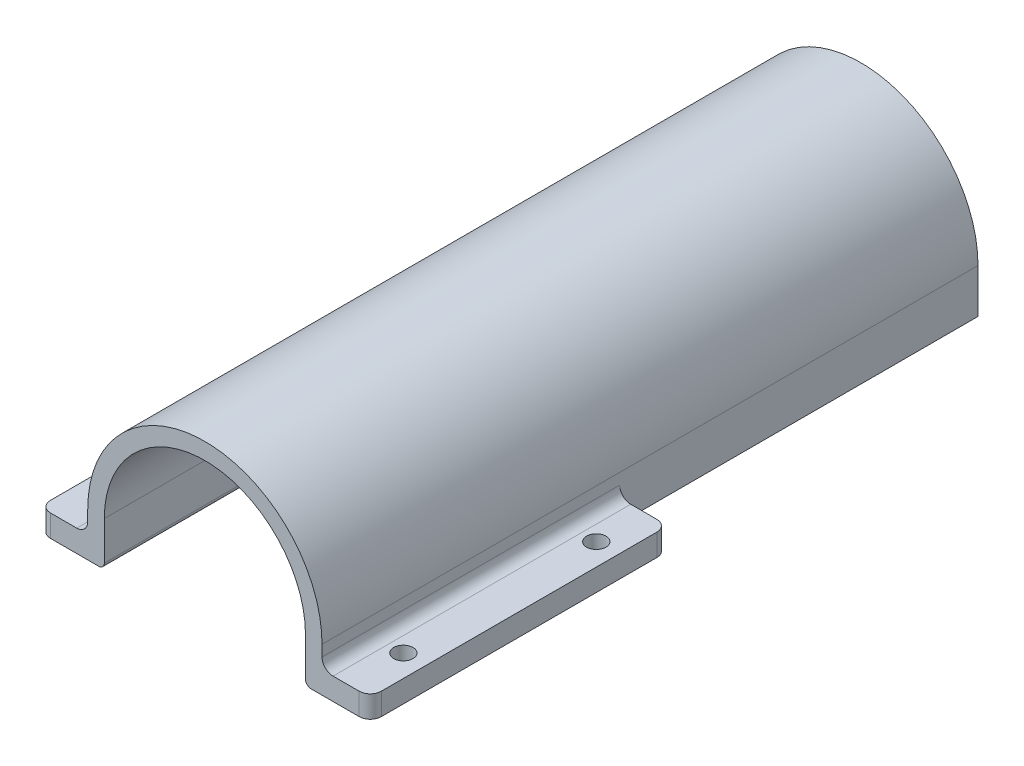
ISO-10303-21;
HEADER;
FILE_DESCRIPTION(('STEP AP214'),'2;1');
FILE_NAME('part.step','',(''),(''),'','','');
FILE_SCHEMA(('AUTOMOTIVE_DESIGN { 1 0 10303 214 1 1 1 1 }'));
ENDSEC;
DATA;
#1=APPLICATION_CONTEXT('core data for automotive mechanical design processes');
#2=APPLICATION_PROTOCOL_DEFINITION('international standard','automotive_design',2000,#1);
#3=PRODUCT_CONTEXT('',#1,'mechanical');
#4=PRODUCT('Part','Part','',(#3));
#5=PRODUCT_RELATED_PRODUCT_CATEGORY('part','',(#4));
#6=PRODUCT_DEFINITION_FORMATION('','',#4);
#7=PRODUCT_DEFINITION_CONTEXT('part definition',#1,'design');
#8=PRODUCT_DEFINITION('design','',#6,#7);
#9=PRODUCT_DEFINITION_SHAPE('','',#8);
#10=(LENGTH_UNIT() NAMED_UNIT(*) SI_UNIT(.MILLI.,.METRE.));
#11=(NAMED_UNIT(*) PLANE_ANGLE_UNIT() SI_UNIT($,.RADIAN.));
#12=(NAMED_UNIT(*) SI_UNIT($,.STERADIAN.) SOLID_ANGLE_UNIT());
#13=UNCERTAINTY_MEASURE_WITH_UNIT(LENGTH_MEASURE(1.E-05),#10,'distance_accuracy_value','');
#14=(GEOMETRIC_REPRESENTATION_CONTEXT(3) GLOBAL_UNCERTAINTY_ASSIGNED_CONTEXT((#13)) GLOBAL_UNIT_ASSIGNED_CONTEXT((#10,
#11,#12)) REPRESENTATION_CONTEXT('',''));
#15=CARTESIAN_POINT('',(0.,0.,0.));
#16=DIRECTION('',(0.,0.,1.));
#17=DIRECTION('',(1.,0.,0.));
#18=AXIS2_PLACEMENT_3D('',#15,#16,#17);
#19=CARTESIAN_POINT('',(-18.25,0.,54.));
#20=DIRECTION('',(1.,0.,0.));
#21=DIRECTION('',(0.,0.,-1.));
#22=AXIS2_PLACEMENT_3D('',#19,#20,#21);
#23=PLANE('',#22);
#24=DIRECTION('',(0.,0.,-1.));
#25=VECTOR('',#24,1.);
#26=CARTESIAN_POINT('',(-18.25,1.,0.));
#27=LINE('',#26,#25);
#28=CARTESIAN_POINT('',(-18.25,1.,54.));
#29=VERTEX_POINT('',#28);
#30=CARTESIAN_POINT('',(-18.25,1.,-63.));
#31=VERTEX_POINT('',#30);
#32=EDGE_CURVE('E48',#29,#31,#27,.T.);
#33=ORIENTED_EDGE('',*,*,#32,.T.);
#34=DIRECTION('',(0.,-1.,0.));
#35=VECTOR('',#34,1.);
#36=CARTESIAN_POINT('',(-18.25,0.,-63.));
#37=LINE('',#36,#35);
#38=CARTESIAN_POINT('',(-18.25,8.,-63.));
#39=VERTEX_POINT('',#38);
#40=EDGE_CURVE('E216',#39,#31,#37,.T.);
#41=ORIENTED_EDGE('',*,*,#40,.F.);
#42=DIRECTION('',(0.,0.,-1.));
#43=VECTOR('',#42,1.);
#44=CARTESIAN_POINT('',(-18.25,8.,54.));
#45=LINE('',#44,#43);
#46=CARTESIAN_POINT('',(-18.25,8.,54.));
#47=VERTEX_POINT('',#46);
#48=EDGE_CURVE('E390',#47,#39,#45,.T.);
#49=ORIENTED_EDGE('',*,*,#48,.F.);
#50=DIRECTION('',(0.,-1.,0.));
#51=VECTOR('',#50,1.);
#52=CARTESIAN_POINT('',(-18.25,0.,54.));
#53=LINE('',#52,#51);
#54=EDGE_CURVE('E241',#47,#29,#53,.T.);
#55=ORIENTED_EDGE('',*,*,#54,.T.);
#56=EDGE_LOOP('',(#33,#41,#49,#55));
#57=FACE_BOUND('',#56,.T.);
#58=ADVANCED_FACE('F40',(#57),#23,.T.);
#59=CARTESIAN_POINT('',(0.,8.,54.));
#60=DIRECTION('',(0.,0.,-1.));
#61=DIRECTION('',(-1.,0.,0.));
#62=AXIS2_PLACEMENT_3D('',#59,#60,#61);
#63=CYLINDRICAL_SURFACE('',#62,18.25);
#64=ORIENTED_EDGE('',*,*,#48,.T.);
#65=CARTESIAN_POINT('',(0.,8.,-63.));
#66=DIRECTION('',(0.,0.,-1.));
#67=DIRECTION('',(-1.,0.,0.));
#68=AXIS2_PLACEMENT_3D('',#65,#66,#67);
#69=CIRCLE('',#68,18.25);
#70=CARTESIAN_POINT('',(18.25,8.,-63.));
#71=VERTEX_POINT('',#70);
#72=EDGE_CURVE('E248',#71,#39,#69,.F.);
#73=ORIENTED_EDGE('',*,*,#72,.F.);
#74=DIRECTION('',(0.,0.,-1.));
#75=VECTOR('',#74,1.);
#76=CARTESIAN_POINT('',(18.25,8.,54.));
#77=LINE('',#76,#75);
#78=CARTESIAN_POINT('',(18.25,8.,54.));
#79=VERTEX_POINT('',#78);
#80=EDGE_CURVE('E223',#79,#71,#77,.T.);
#81=ORIENTED_EDGE('',*,*,#80,.F.);
#82=CARTESIAN_POINT('',(0.,8.,54.));
#83=DIRECTION('',(0.,0.,1.));
#84=DIRECTION('',(1.,0.,0.));
#85=AXIS2_PLACEMENT_3D('',#82,#83,#84);
#86=CIRCLE('',#85,18.25);
#87=EDGE_CURVE('E342',#79,#47,#86,.T.);
#88=ORIENTED_EDGE('',*,*,#87,.T.);
#89=EDGE_LOOP('',(#64,#73,#81,#88));
#90=FACE_BOUND('',#89,.T.);
#91=ADVANCED_FACE('F473',(#90),#63,.F.);
#92=CARTESIAN_POINT('',(18.25,0.,54.));
#93=DIRECTION('',(1.,0.,0.));
#94=DIRECTION('',(0.,0.,-1.));
#95=AXIS2_PLACEMENT_3D('',#92,#93,#94);
#96=PLANE('',#95);
#97=DIRECTION('',(0.,1.,0.));
#98=VECTOR('',#97,1.);
#99=CARTESIAN_POINT('',(18.25,0.,-63.));
#100=LINE('',#99,#98);
#101=CARTESIAN_POINT('',(18.25,1.,-63.));
#102=VERTEX_POINT('',#101);
#103=EDGE_CURVE('E213',#102,#71,#100,.T.);
#104=ORIENTED_EDGE('',*,*,#103,.F.);
#105=DIRECTION('',(0.,0.,-1.));
#106=VECTOR('',#105,1.);
#107=CARTESIAN_POINT('',(18.25,1.,54.));
#108=LINE('',#107,#106);
#109=CARTESIAN_POINT('',(18.25,1.,54.));
#110=VERTEX_POINT('',#109);
#111=EDGE_CURVE('E208',#102,#110,#108,.F.);
#112=ORIENTED_EDGE('',*,*,#111,.T.);
#113=DIRECTION('',(0.,-1.,0.));
#114=VECTOR('',#113,1.);
#115=CARTESIAN_POINT('',(18.25,0.,54.));
#116=LINE('',#115,#114);
#117=EDGE_CURVE('E345',#79,#110,#116,.T.);
#118=ORIENTED_EDGE('',*,*,#117,.F.);
#119=ORIENTED_EDGE('',*,*,#80,.T.);
#120=EDGE_LOOP('',(#104,#112,#118,#119));
#121=FACE_BOUND('',#120,.T.);
#122=ADVANCED_FACE('F220',(#121),#96,.F.);
#123=CARTESIAN_POINT('',(0.,0.,0.));
#124=DIRECTION('',(0.,0.,1.));
#125=DIRECTION('',(1.,0.,0.));
#126=AXIS2_PLACEMENT_3D('',#123,#124,#125);
#127=PLANE('',#126);
#128=DIRECTION('',(0.,-1.,0.));
#129=VECTOR('',#128,1.);
#130=CARTESIAN_POINT('',(21.25,0.,0.));
#131=LINE('',#130,#129);
#132=CARTESIAN_POINT('',(21.25,6.,0.));
#133=VERTEX_POINT('',#132);
#134=CARTESIAN_POINT('',(21.25,0.,0.));
#135=VERTEX_POINT('',#134);
#136=EDGE_CURVE('E250',#133,#135,#131,.T.);
#137=ORIENTED_EDGE('',*,*,#136,.F.);
#138=CARTESIAN_POINT('',(23.25,6.,0.));
#139=DIRECTION('',(0.,0.,1.));
#140=DIRECTION('',(1.,0.,0.));
#141=AXIS2_PLACEMENT_3D('',#138,#139,#140);
#142=CIRCLE('',#141,2.);
#143=CARTESIAN_POINT('',(23.25,4.,0.));
#144=VERTEX_POINT('',#143);
#145=EDGE_CURVE('E336',#144,#133,#142,.F.);
#146=ORIENTED_EDGE('',*,*,#145,.F.);
#147=DIRECTION('',(-1.,0.,0.));
#148=VECTOR('',#147,1.);
#149=CARTESIAN_POINT('',(0.,4.,0.));
#150=LINE('',#149,#148);
#151=CARTESIAN_POINT('',(28.,4.,0.));
#152=VERTEX_POINT('',#151);
#153=EDGE_CURVE('E368',#152,#144,#150,.T.);
#154=ORIENTED_EDGE('',*,*,#153,.F.);
#155=DIRECTION('',(0.,-1.,0.));
#156=VECTOR('',#155,1.);
#157=CARTESIAN_POINT('',(28.,29.251,0.));
#158=LINE('',#157,#156);
#159=CARTESIAN_POINT('',(28.,0.,0.));
#160=VERTEX_POINT('',#159);
#161=EDGE_CURVE('E321',#152,#160,#158,.T.);
#162=ORIENTED_EDGE('',*,*,#161,.T.);
#163=DIRECTION('',(-1.,0.,0.));
#164=VECTOR('',#163,1.);
#165=CARTESIAN_POINT('',(0.,0.,0.));
#166=LINE('',#165,#164);
#167=EDGE_CURVE('E63',#160,#135,#166,.T.);
#168=ORIENTED_EDGE('',*,*,#167,.T.);
#169=EDGE_LOOP('',(#137,#146,#154,#162,#168));
#170=FACE_BOUND('',#169,.T.);
#171=ADVANCED_FACE('F480',(#170),#127,.F.);
#172=CARTESIAN_POINT('',(0.,4.,54.));
#173=DIRECTION('',(0.,1.,0.));
#174=DIRECTION('',(-1.,0.,0.));
#175=AXIS2_PLACEMENT_3D('',#172,#173,#174);
#176=PLANE('',#175);
#177=CARTESIAN_POINT('',(-26.,4.,9.00000000000001));
#178=DIRECTION('',(0.,1.,0.));
#179=DIRECTION('',(-1.,0.,0.));
#180=AXIS2_PLACEMENT_3D('',#177,#178,#179);
#181=CIRCLE('',#180,1.75);
#182=CARTESIAN_POINT('',(-27.75,4.,9.00000000000001));
#183=VERTEX_POINT('',#182);
#184=EDGE_CURVE('E279',#183,#183,#181,.T.);
#185=ORIENTED_EDGE('',*,*,#184,.F.);
#186=EDGE_LOOP('',(#185));
#187=FACE_BOUND('',#186,.T.);
#188=CARTESIAN_POINT('',(-25.9999999999996,4.,44.));
#189=DIRECTION('',(0.,1.,0.));
#190=DIRECTION('',(-1.,0.,0.));
#191=AXIS2_PLACEMENT_3D('',#188,#189,#190);
#192=CIRCLE('',#191,1.75);
#193=CARTESIAN_POINT('',(-27.7499999999996,4.,44.));
#194=VERTEX_POINT('',#193);
#195=EDGE_CURVE('E278',#194,#194,#192,.T.);
#196=ORIENTED_EDGE('',*,*,#195,.F.);
#197=EDGE_LOOP('',(#196));
#198=FACE_BOUND('',#197,.T.);
#199=CARTESIAN_POINT('',(-28.,4.,2.00000000000001));
#200=DIRECTION('',(0.,1.,0.));
#201=DIRECTION('',(-1.,0.,0.));
#202=AXIS2_PLACEMENT_3D('',#199,#200,#201);
#203=CIRCLE('',#202,2.);
#204=CARTESIAN_POINT('',(-28.,4.,0.));
#205=VERTEX_POINT('',#204);
#206=CARTESIAN_POINT('',(-30.,4.,2.00000000000002));
#207=VERTEX_POINT('',#206);
#208=EDGE_CURVE('E285',#205,#207,#203,.T.);
#209=ORIENTED_EDGE('',*,*,#208,.T.);
#210=DIRECTION('',(0.,0.,-1.));
#211=VECTOR('',#210,1.);
#212=CARTESIAN_POINT('',(-30.,4.,54.));
#213=LINE('',#212,#211);
#214=CARTESIAN_POINT('',(-30.,4.,52.));
#215=VERTEX_POINT('',#214);
#216=EDGE_CURVE('E395',#215,#207,#213,.T.);
#217=ORIENTED_EDGE('',*,*,#216,.F.);
#218=CARTESIAN_POINT('',(-28.,4.,52.));
#219=DIRECTION('',(0.,1.,0.));
#220=DIRECTION('',(-1.,0.,0.));
#221=AXIS2_PLACEMENT_3D('',#218,#219,#220);
#222=CIRCLE('',#221,2.);
#223=CARTESIAN_POINT('',(-28.,4.,54.));
#224=VERTEX_POINT('',#223);
#225=EDGE_CURVE('E282',#215,#224,#222,.T.);
#226=ORIENTED_EDGE('',*,*,#225,.T.);
#227=DIRECTION('',(1.,0.,0.));
#228=VECTOR('',#227,1.);
#229=CARTESIAN_POINT('',(0.,4.,54.));
#230=LINE('',#229,#228);
#231=CARTESIAN_POINT('',(-23.25,4.,54.));
#232=VERTEX_POINT('',#231);
#233=EDGE_CURVE('E335',#224,#232,#230,.T.);
#234=ORIENTED_EDGE('',*,*,#233,.T.);
#235=DIRECTION('',(0.,0.,-1.));
#236=VECTOR('',#235,1.);
#237=CARTESIAN_POINT('',(-23.25,4.,54.));
#238=LINE('',#237,#236);
#239=CARTESIAN_POINT('',(-23.25,4.,0.));
#240=VERTEX_POINT('',#239);
#241=EDGE_CURVE('E398',#232,#240,#238,.T.);
#242=ORIENTED_EDGE('',*,*,#241,.T.);
#243=DIRECTION('',(1.,0.,0.));
#244=VECTOR('',#243,1.);
#245=CARTESIAN_POINT('',(0.,4.,0.));
#246=LINE('',#245,#244);
#247=EDGE_CURVE('E363',#205,#240,#246,.T.);
#248=ORIENTED_EDGE('',*,*,#247,.F.);
#249=EDGE_LOOP('',(#209,#217,#226,#234,#242,#248));
#250=FACE_BOUND('',#249,.T.);
#251=ADVANCED_FACE('F451',(#187,#198,#250),#176,.T.);
#252=CARTESIAN_POINT('',(-30.,0.,54.));
#253=DIRECTION('',(-1.,0.,0.));
#254=DIRECTION('',(0.,0.,1.));
#255=AXIS2_PLACEMENT_3D('',#252,#253,#254);
#256=PLANE('',#255);
#257=DIRECTION('',(0.,-1.,0.));
#258=VECTOR('',#257,1.);
#259=CARTESIAN_POINT('',(-30.,29.251,2.00000000000002));
#260=LINE('',#259,#258);
#261=CARTESIAN_POINT('',(-30.,0.,2.00000000000002));
#262=VERTEX_POINT('',#261);
#263=EDGE_CURVE('E316',#207,#262,#260,.T.);
#264=ORIENTED_EDGE('',*,*,#263,.T.);
#265=DIRECTION('',(0.,0.,-1.));
#266=VECTOR('',#265,1.);
#267=CARTESIAN_POINT('',(-30.,0.,54.));
#268=LINE('',#267,#266);
#269=CARTESIAN_POINT('',(-30.,0.,52.));
#270=VERTEX_POINT('',#269);
#271=EDGE_CURVE('E392',#270,#262,#268,.T.);
#272=ORIENTED_EDGE('',*,*,#271,.F.);
#273=DIRECTION('',(0.,-1.,0.));
#274=VECTOR('',#273,1.);
#275=CARTESIAN_POINT('',(-30.,29.251,52.));
#276=LINE('',#275,#274);
#277=EDGE_CURVE('E313',#215,#270,#276,.T.);
#278=ORIENTED_EDGE('',*,*,#277,.F.);
#279=ORIENTED_EDGE('',*,*,#216,.T.);
#280=EDGE_LOOP('',(#264,#272,#278,#279));
#281=FACE_BOUND('',#280,.T.);
#282=ADVANCED_FACE('F418',(#281),#256,.T.);
#283=CARTESIAN_POINT('',(0.,0.,54.));
#284=DIRECTION('',(0.,1.,0.));
#285=DIRECTION('',(0.,0.,1.));
#286=AXIS2_PLACEMENT_3D('',#283,#284,#285);
#287=PLANE('',#286);
#288=CARTESIAN_POINT('',(-26.,0.,9.00000000000001));
#289=DIRECTION('',(0.,1.,0.));
#290=DIRECTION('',(0.,0.,1.));
#291=AXIS2_PLACEMENT_3D('',#288,#289,#290);
#292=CIRCLE('',#291,1.75);
#293=CARTESIAN_POINT('',(-26.,0.,10.75));
#294=VERTEX_POINT('',#293);
#295=EDGE_CURVE('E230',#294,#294,#292,.F.);
#296=ORIENTED_EDGE('',*,*,#295,.F.);
#297=EDGE_LOOP('',(#296));
#298=FACE_BOUND('',#297,.T.);
#299=CARTESIAN_POINT('',(-25.9999999999996,0.,44.));
#300=DIRECTION('',(0.,1.,0.));
#301=DIRECTION('',(0.,0.,1.));
#302=AXIS2_PLACEMENT_3D('',#299,#300,#301);
#303=CIRCLE('',#302,1.75);
#304=CARTESIAN_POINT('',(-25.9999999999996,0.,45.75));
#305=VERTEX_POINT('',#304);
#306=EDGE_CURVE('E407',#305,#305,#303,.F.);
#307=ORIENTED_EDGE('',*,*,#306,.F.);
#308=EDGE_LOOP('',(#307));
#309=FACE_BOUND('',#308,.T.);
#310=DIRECTION('',(1.,0.,0.));
#311=VECTOR('',#310,1.);
#312=CARTESIAN_POINT('',(0.,0.,0.));
#313=LINE('',#312,#311);
#314=CARTESIAN_POINT('',(-28.,0.,0.));
#315=VERTEX_POINT('',#314);
#316=CARTESIAN_POINT('',(-21.25,0.,0.));
#317=VERTEX_POINT('',#316);
#318=EDGE_CURVE('E365',#315,#317,#313,.T.);
#319=ORIENTED_EDGE('',*,*,#318,.T.);
#320=DIRECTION('',(0.,0.,1.));
#321=VECTOR('',#320,1.);
#322=CARTESIAN_POINT('',(-21.25,0.,-65.));
#323=LINE('',#322,#321);
#324=CARTESIAN_POINT('',(-21.25,0.,-65.));
#325=VERTEX_POINT('',#324);
#326=EDGE_CURVE('E270',#325,#317,#323,.T.);
#327=ORIENTED_EDGE('',*,*,#326,.F.);
#328=DIRECTION('',(-1.,0.,0.));
#329=VECTOR('',#328,1.);
#330=CARTESIAN_POINT('',(0.,0.,-65.));
#331=LINE('',#330,#329);
#332=CARTESIAN_POINT('',(-19.25,0.,-65.));
#333=VERTEX_POINT('',#332);
#334=EDGE_CURVE('E269',#333,#325,#331,.T.);
#335=ORIENTED_EDGE('',*,*,#334,.F.);
#336=DIRECTION('',(0.,0.,-1.));
#337=VECTOR('',#336,1.);
#338=CARTESIAN_POINT('',(-19.25,0.,54.));
#339=LINE('',#338,#337);
#340=CARTESIAN_POINT('',(-19.25,0.,54.));
#341=VERTEX_POINT('',#340);
#342=EDGE_CURVE('E11',#333,#341,#339,.F.);
#343=ORIENTED_EDGE('',*,*,#342,.T.);
#344=DIRECTION('',(1.,0.,0.));
#345=VECTOR('',#344,1.);
#346=CARTESIAN_POINT('',(0.,0.,54.));
#347=LINE('',#346,#345);
#348=CARTESIAN_POINT('',(-28.,0.,54.));
#349=VERTEX_POINT('',#348);
#350=EDGE_CURVE('E338',#349,#341,#347,.T.);
#351=ORIENTED_EDGE('',*,*,#350,.F.);
#352=CARTESIAN_POINT('',(-28.,0.,52.));
#353=DIRECTION('',(0.,1.,0.));
#354=DIRECTION('',(0.,0.,-1.));
#355=AXIS2_PLACEMENT_3D('',#352,#353,#354);
#356=CIRCLE('',#355,2.);
#357=EDGE_CURVE('E306',#270,#349,#356,.T.);
#358=ORIENTED_EDGE('',*,*,#357,.F.);
#359=ORIENTED_EDGE('',*,*,#271,.T.);
#360=CARTESIAN_POINT('',(-28.,0.,2.00000000000001));
#361=DIRECTION('',(0.,1.,0.));
#362=DIRECTION('',(0.,0.,1.));
#363=AXIS2_PLACEMENT_3D('',#360,#361,#362);
#364=CIRCLE('',#363,2.);
#365=EDGE_CURVE('E304',#315,#262,#364,.T.);
#366=ORIENTED_EDGE('',*,*,#365,.F.);
#367=EDGE_LOOP('',(#319,#327,#335,#343,#351,#358,#359,#366));
#368=FACE_BOUND('',#367,.T.);
#369=ADVANCED_FACE('F414',(#298,#309,#368),#287,.F.);
#370=CARTESIAN_POINT('',(0.,0.,54.));
#371=DIRECTION('',(0.,-1.,0.));
#372=DIRECTION('',(0.,0.,-1.));
#373=AXIS2_PLACEMENT_3D('',#370,#371,#372);
#374=PLANE('',#373);
#375=CARTESIAN_POINT('',(26.,0.,9.00000000000001));
#376=DIRECTION('',(0.,1.,0.));
#377=DIRECTION('',(0.,0.,1.));
#378=AXIS2_PLACEMENT_3D('',#375,#376,#377);
#379=CIRCLE('',#378,1.75);
#380=CARTESIAN_POINT('',(26.,0.,10.75));
#381=VERTEX_POINT('',#380);
#382=EDGE_CURVE('E296',#381,#381,#379,.T.);
#383=ORIENTED_EDGE('',*,*,#382,.T.);
#384=EDGE_LOOP('',(#383));
#385=FACE_BOUND('',#384,.T.);
#386=CARTESIAN_POINT('',(26.0000000000004,0.,44.));
#387=DIRECTION('',(0.,1.,0.));
#388=DIRECTION('',(0.,0.,1.));
#389=AXIS2_PLACEMENT_3D('',#386,#387,#388);
#390=CIRCLE('',#389,1.75);
#391=CARTESIAN_POINT('',(26.0000000000004,0.,45.75));
#392=VERTEX_POINT('',#391);
#393=EDGE_CURVE('E293',#392,#392,#390,.T.);
#394=ORIENTED_EDGE('',*,*,#393,.T.);
#395=EDGE_LOOP('',(#394));
#396=FACE_BOUND('',#395,.T.);
#397=DIRECTION('',(-1.,0.,0.));
#398=VECTOR('',#397,1.);
#399=CARTESIAN_POINT('',(0.,0.,54.));
#400=LINE('',#399,#398);
#401=CARTESIAN_POINT('',(28.,0.,54.));
#402=VERTEX_POINT('',#401);
#403=CARTESIAN_POINT('',(19.25,0.,54.));
#404=VERTEX_POINT('',#403);
#405=EDGE_CURVE('E347',#402,#404,#400,.T.);
#406=ORIENTED_EDGE('',*,*,#405,.T.);
#407=DIRECTION('',(0.,0.,-1.));
#408=VECTOR('',#407,1.);
#409=CARTESIAN_POINT('',(19.25,0.,0.));
#410=LINE('',#409,#408);
#411=CARTESIAN_POINT('',(19.25,0.,-65.));
#412=VERTEX_POINT('',#411);
#413=EDGE_CURVE('E229',#404,#412,#410,.T.);
#414=ORIENTED_EDGE('',*,*,#413,.T.);
#415=DIRECTION('',(-1.,0.,0.));
#416=VECTOR('',#415,1.);
#417=CARTESIAN_POINT('',(0.,0.,-65.));
#418=LINE('',#417,#416);
#419=CARTESIAN_POINT('',(21.25,0.,-65.));
#420=VERTEX_POINT('',#419);
#421=EDGE_CURVE('E263',#420,#412,#418,.T.);
#422=ORIENTED_EDGE('',*,*,#421,.F.);
#423=DIRECTION('',(0.,0.,1.));
#424=VECTOR('',#423,1.);
#425=CARTESIAN_POINT('',(21.25,0.,-65.));
#426=LINE('',#425,#424);
#427=EDGE_CURVE('E275',#420,#135,#426,.T.);
#428=ORIENTED_EDGE('',*,*,#427,.T.);
#429=ORIENTED_EDGE('',*,*,#167,.F.);
#430=CARTESIAN_POINT('',(28.,0.,2.00000000000001));
#431=DIRECTION('',(0.,1.,0.));
#432=DIRECTION('',(0.,0.,1.));
#433=AXIS2_PLACEMENT_3D('',#430,#431,#432);
#434=CIRCLE('',#433,2.);
#435=CARTESIAN_POINT('',(30.,0.,2.00000000000001));
#436=VERTEX_POINT('',#435);
#437=EDGE_CURVE('E301',#436,#160,#434,.T.);
#438=ORIENTED_EDGE('',*,*,#437,.F.);
#439=DIRECTION('',(0.,0.,-1.));
#440=VECTOR('',#439,1.);
#441=CARTESIAN_POINT('',(30.,0.,54.));
#442=LINE('',#441,#440);
#443=CARTESIAN_POINT('',(30.,0.,52.));
#444=VERTEX_POINT('',#443);
#445=EDGE_CURVE('E386',#444,#436,#442,.T.);
#446=ORIENTED_EDGE('',*,*,#445,.F.);
#447=CARTESIAN_POINT('',(28.,0.,52.));
#448=DIRECTION('',(0.,1.,0.));
#449=DIRECTION('',(0.,0.,-1.));
#450=AXIS2_PLACEMENT_3D('',#447,#448,#449);
#451=CIRCLE('',#450,2.);
#452=EDGE_CURVE('E299',#402,#444,#451,.T.);
#453=ORIENTED_EDGE('',*,*,#452,.F.);
#454=EDGE_LOOP('',(#406,#414,#422,#428,#429,#438,#446,#453));
#455=FACE_BOUND('',#454,.T.);
#456=ADVANCED_FACE('F417',(#385,#396,#455),#374,.T.);
#457=CARTESIAN_POINT('',(30.,0.,54.));
#458=DIRECTION('',(-1.,0.,0.));
#459=DIRECTION('',(0.,0.,1.));
#460=AXIS2_PLACEMENT_3D('',#457,#458,#459);
#461=PLANE('',#460);
#462=DIRECTION('',(0.,-1.,0.));
#463=VECTOR('',#462,1.);
#464=CARTESIAN_POINT('',(30.,29.251,52.));
#465=LINE('',#464,#463);
#466=CARTESIAN_POINT('',(30.,4.,52.));
#467=VERTEX_POINT('',#466);
#468=EDGE_CURVE('E326',#467,#444,#465,.T.);
#469=ORIENTED_EDGE('',*,*,#468,.T.);
#470=ORIENTED_EDGE('',*,*,#445,.T.);
#471=DIRECTION('',(0.,-1.,0.));
#472=VECTOR('',#471,1.);
#473=CARTESIAN_POINT('',(30.,29.251,2.00000000000002));
#474=LINE('',#473,#472);
#475=CARTESIAN_POINT('',(30.,4.,2.00000000000001));
#476=VERTEX_POINT('',#475);
#477=EDGE_CURVE('E323',#476,#436,#474,.T.);
#478=ORIENTED_EDGE('',*,*,#477,.F.);
#479=DIRECTION('',(0.,0.,-1.));
#480=VECTOR('',#479,1.);
#481=CARTESIAN_POINT('',(30.,4.,54.));
#482=LINE('',#481,#480);
#483=EDGE_CURVE('E383',#467,#476,#482,.T.);
#484=ORIENTED_EDGE('',*,*,#483,.F.);
#485=EDGE_LOOP('',(#469,#470,#478,#484));
#486=FACE_BOUND('',#485,.T.);
#487=ADVANCED_FACE('F538',(#486),#461,.F.);
#488=CARTESIAN_POINT('',(0.,4.,54.));
#489=DIRECTION('',(0.,-1.,0.));
#490=DIRECTION('',(1.,0.,0.));
#491=AXIS2_PLACEMENT_3D('',#488,#489,#490);
#492=PLANE('',#491);
#493=CARTESIAN_POINT('',(26.,4.,9.00000000000001));
#494=DIRECTION('',(0.,-1.,0.));
#495=DIRECTION('',(1.,0.,0.));
#496=AXIS2_PLACEMENT_3D('',#493,#494,#495);
#497=CIRCLE('',#496,1.75);
#498=CARTESIAN_POINT('',(27.75,4.,9.00000000000001));
#499=VERTEX_POINT('',#498);
#500=EDGE_CURVE('E404',#499,#499,#497,.F.);
#501=ORIENTED_EDGE('',*,*,#500,.F.);
#502=EDGE_LOOP('',(#501));
#503=FACE_BOUND('',#502,.T.);
#504=CARTESIAN_POINT('',(26.0000000000004,4.,44.));
#505=DIRECTION('',(0.,-1.,0.));
#506=DIRECTION('',(1.,0.,0.));
#507=AXIS2_PLACEMENT_3D('',#504,#505,#506);
#508=CIRCLE('',#507,1.75);
#509=CARTESIAN_POINT('',(27.7500000000004,4.,44.));
#510=VERTEX_POINT('',#509);
#511=EDGE_CURVE('E401',#510,#510,#508,.F.);
#512=ORIENTED_EDGE('',*,*,#511,.F.);
#513=EDGE_LOOP('',(#512));
#514=FACE_BOUND('',#513,.T.);
#515=DIRECTION('',(-1.,0.,0.));
#516=VECTOR('',#515,1.);
#517=CARTESIAN_POINT('',(0.,4.,54.));
#518=LINE('',#517,#516);
#519=CARTESIAN_POINT('',(28.,4.,54.));
#520=VERTEX_POINT('',#519);
#521=CARTESIAN_POINT('',(23.25,4.,54.));
#522=VERTEX_POINT('',#521);
#523=EDGE_CURVE('E350',#520,#522,#518,.T.);
#524=ORIENTED_EDGE('',*,*,#523,.F.);
#525=CARTESIAN_POINT('',(28.,4.,52.));
#526=DIRECTION('',(0.,-1.,0.));
#527=DIRECTION('',(1.,0.,0.));
#528=AXIS2_PLACEMENT_3D('',#525,#526,#527);
#529=CIRCLE('',#528,2.);
#530=EDGE_CURVE('E291',#467,#520,#529,.T.);
#531=ORIENTED_EDGE('',*,*,#530,.F.);
#532=ORIENTED_EDGE('',*,*,#483,.T.);
#533=CARTESIAN_POINT('',(28.,4.,2.00000000000001));
#534=DIRECTION('',(0.,-1.,0.));
#535=DIRECTION('',(1.,0.,0.));
#536=AXIS2_PLACEMENT_3D('',#533,#534,#535);
#537=CIRCLE('',#536,2.);
#538=EDGE_CURVE('E288',#152,#476,#537,.T.);
#539=ORIENTED_EDGE('',*,*,#538,.F.);
#540=ORIENTED_EDGE('',*,*,#153,.T.);
#541=DIRECTION('',(0.,0.,-1.));
#542=VECTOR('',#541,1.);
#543=CARTESIAN_POINT('',(23.25,4.,54.));
#544=LINE('',#543,#542);
#545=EDGE_CURVE('E380',#522,#144,#544,.T.);
#546=ORIENTED_EDGE('',*,*,#545,.F.);
#547=EDGE_LOOP('',(#524,#531,#532,#539,#540,#546));
#548=FACE_BOUND('',#547,.T.);
#549=ADVANCED_FACE('F524',(#503,#514,#548),#492,.F.);
#550=CARTESIAN_POINT('',(0.,0.,54.));
#551=DIRECTION('',(0.,0.,1.));
#552=DIRECTION('',(1.,0.,0.));
#553=AXIS2_PLACEMENT_3D('',#550,#551,#552);
#554=PLANE('',#553);
#555=ORIENTED_EDGE('',*,*,#117,.T.);
#556=CARTESIAN_POINT('',(19.25,1.,54.));
#557=DIRECTION('',(0.,0.,1.));
#558=DIRECTION('',(1.,0.,0.));
#559=AXIS2_PLACEMENT_3D('',#556,#557,#558);
#560=CIRCLE('',#559,1.);
#561=EDGE_CURVE('E228',#110,#404,#560,.T.);
#562=ORIENTED_EDGE('',*,*,#561,.T.);
#563=ORIENTED_EDGE('',*,*,#405,.F.);
#564=DIRECTION('',(0.,-1.,0.));
#565=VECTOR('',#564,1.);
#566=CARTESIAN_POINT('',(28.,29.251,54.));
#567=LINE('',#566,#565);
#568=EDGE_CURVE('E309',#520,#402,#567,.T.);
#569=ORIENTED_EDGE('',*,*,#568,.F.);
#570=ORIENTED_EDGE('',*,*,#523,.T.);
#571=CARTESIAN_POINT('',(23.25,6.,54.));
#572=DIRECTION('',(0.,0.,1.));
#573=DIRECTION('',(1.,0.,0.));
#574=AXIS2_PLACEMENT_3D('',#571,#572,#573);
#575=CIRCLE('',#574,2.);
#576=CARTESIAN_POINT('',(21.25,6.,54.));
#577=VERTEX_POINT('',#576);
#578=EDGE_CURVE('E352',#522,#577,#575,.F.);
#579=ORIENTED_EDGE('',*,*,#578,.T.);
#580=DIRECTION('',(0.,-1.,0.));
#581=VECTOR('',#580,1.);
#582=CARTESIAN_POINT('',(21.25,0.,54.));
#583=LINE('',#582,#581);
#584=CARTESIAN_POINT('',(21.25,8.,54.));
#585=VERTEX_POINT('',#584);
#586=EDGE_CURVE('E354',#585,#577,#583,.T.);
#587=ORIENTED_EDGE('',*,*,#586,.F.);
#588=CARTESIAN_POINT('',(0.,8.,54.));
#589=DIRECTION('',(0.,0.,1.));
#590=DIRECTION('',(1.,0.,0.));
#591=AXIS2_PLACEMENT_3D('',#588,#589,#590);
#592=CIRCLE('',#591,21.25);
#593=CARTESIAN_POINT('',(-21.25,8.,54.));
#594=VERTEX_POINT('',#593);
#595=EDGE_CURVE('E357',#585,#594,#592,.T.);
#596=ORIENTED_EDGE('',*,*,#595,.T.);
#597=DIRECTION('',(0.,-1.,0.));
#598=VECTOR('',#597,1.);
#599=CARTESIAN_POINT('',(-21.25,0.,54.));
#600=LINE('',#599,#598);
#601=CARTESIAN_POINT('',(-21.25,6.,54.));
#602=VERTEX_POINT('',#601);
#603=EDGE_CURVE('E359',#594,#602,#600,.T.);
#604=ORIENTED_EDGE('',*,*,#603,.T.);
#605=CARTESIAN_POINT('',(-23.25,6.,54.));
#606=DIRECTION('',(0.,0.,1.));
#607=DIRECTION('',(1.,0.,0.));
#608=AXIS2_PLACEMENT_3D('',#605,#606,#607);
#609=CIRCLE('',#608,2.);
#610=EDGE_CURVE('E332',#232,#602,#609,.T.);
#611=ORIENTED_EDGE('',*,*,#610,.F.);
#612=ORIENTED_EDGE('',*,*,#233,.F.);
#613=DIRECTION('',(0.,-1.,0.));
#614=VECTOR('',#613,1.);
#615=CARTESIAN_POINT('',(-28.,29.251,54.));
#616=LINE('',#615,#614);
#617=EDGE_CURVE('E311',#224,#349,#616,.T.);
#618=ORIENTED_EDGE('',*,*,#617,.T.);
#619=ORIENTED_EDGE('',*,*,#350,.T.);
#620=CARTESIAN_POINT('',(-19.25,1.,54.));
#621=DIRECTION('',(0.,0.,1.));
#622=DIRECTION('',(1.,0.,0.));
#623=AXIS2_PLACEMENT_3D('',#620,#621,#622);
#624=CIRCLE('',#623,1.);
#625=EDGE_CURVE('E207',#341,#29,#624,.T.);
#626=ORIENTED_EDGE('',*,*,#625,.T.);
#627=ORIENTED_EDGE('',*,*,#54,.F.);
#628=ORIENTED_EDGE('',*,*,#87,.F.);
#629=EDGE_LOOP('',(#555,#562,#563,#569,#570,#579,#587,#596,#604,#611,#612,#618,#619,#626,#627,#628));
#630=FACE_BOUND('',#629,.T.);
#631=ADVANCED_FACE('F438',(#630),#554,.T.);
#632=CARTESIAN_POINT('',(-23.25,6.,0.));
#633=DIRECTION('',(0.,0.,1.));
#634=DIRECTION('',(1.,0.,0.));
#635=AXIS2_PLACEMENT_3D('',#632,#633,#634);
#636=CIRCLE('',#635,2.);
#637=CARTESIAN_POINT('',(-21.25,6.,0.));
#638=VERTEX_POINT('',#637);
#639=EDGE_CURVE('E329',#240,#638,#636,.T.);
#640=ORIENTED_EDGE('',*,*,#639,.T.);
#641=DIRECTION('',(0.,-1.,0.));
#642=VECTOR('',#641,1.);
#643=CARTESIAN_POINT('',(-21.25,0.,0.));
#644=LINE('',#643,#642);
#645=EDGE_CURVE('E55',#638,#317,#644,.T.);
#646=ORIENTED_EDGE('',*,*,#645,.T.);
#647=ORIENTED_EDGE('',*,*,#318,.F.);
#648=DIRECTION('',(0.,-1.,0.));
#649=VECTOR('',#648,1.);
#650=CARTESIAN_POINT('',(-28.,29.251,0.));
#651=LINE('',#650,#649);
#652=EDGE_CURVE('E319',#205,#315,#651,.T.);
#653=ORIENTED_EDGE('',*,*,#652,.F.);
#654=ORIENTED_EDGE('',*,*,#247,.T.);
#655=EDGE_LOOP('',(#640,#646,#647,#653,#654));
#656=FACE_BOUND('',#655,.T.);
#657=ADVANCED_FACE('F454',(#656),#127,.F.);
#658=CARTESIAN_POINT('',(-23.25,6.,54.));
#659=DIRECTION('',(0.,0.,-1.));
#660=DIRECTION('',(-1.,0.,0.));
#661=AXIS2_PLACEMENT_3D('',#658,#659,#660);
#662=CYLINDRICAL_SURFACE('',#661,2.);
#663=ORIENTED_EDGE('',*,*,#639,.F.);
#664=ORIENTED_EDGE('',*,*,#241,.F.);
#665=ORIENTED_EDGE('',*,*,#610,.T.);
#666=DIRECTION('',(0.,0.,-1.));
#667=VECTOR('',#666,1.);
#668=CARTESIAN_POINT('',(-21.25,6.,54.));
#669=LINE('',#668,#667);
#670=EDGE_CURVE('E361',#602,#638,#669,.T.);
#671=ORIENTED_EDGE('',*,*,#670,.T.);
#672=EDGE_LOOP('',(#663,#664,#665,#671));
#673=FACE_BOUND('',#672,.T.);
#674=ADVANCED_FACE('F456',(#673),#662,.F.);
#675=CARTESIAN_POINT('',(23.25,6.,54.));
#676=DIRECTION('',(0.,0.,-1.));
#677=DIRECTION('',(-1.,0.,0.));
#678=AXIS2_PLACEMENT_3D('',#675,#676,#677);
#679=CYLINDRICAL_SURFACE('',#678,2.);
#680=ORIENTED_EDGE('',*,*,#145,.T.);
#681=DIRECTION('',(0.,0.,-1.));
#682=VECTOR('',#681,1.);
#683=CARTESIAN_POINT('',(21.25,6.,54.));
#684=LINE('',#683,#682);
#685=EDGE_CURVE('E377',#577,#133,#684,.T.);
#686=ORIENTED_EDGE('',*,*,#685,.F.);
#687=ORIENTED_EDGE('',*,*,#578,.F.);
#688=ORIENTED_EDGE('',*,*,#545,.T.);
#689=EDGE_LOOP('',(#680,#686,#687,#688));
#690=FACE_BOUND('',#689,.T.);
#691=ADVANCED_FACE('F491',(#690),#679,.F.);
#692=CARTESIAN_POINT('',(21.25,0.,54.));
#693=DIRECTION('',(1.,0.,0.));
#694=DIRECTION('',(0.,1.,0.));
#695=AXIS2_PLACEMENT_3D('',#692,#693,#694);
#696=PLANE('',#695);
#697=ORIENTED_EDGE('',*,*,#685,.T.);
#698=ORIENTED_EDGE('',*,*,#136,.T.);
#699=ORIENTED_EDGE('',*,*,#427,.F.);
#700=DIRECTION('',(0.,-1.,0.));
#701=VECTOR('',#700,1.);
#702=CARTESIAN_POINT('',(21.25,0.,-65.));
#703=LINE('',#702,#701);
#704=CARTESIAN_POINT('',(21.25,8.,-65.));
#705=VERTEX_POINT('',#704);
#706=EDGE_CURVE('E261',#705,#420,#703,.T.);
#707=ORIENTED_EDGE('',*,*,#706,.F.);
#708=DIRECTION('',(0.,0.,-1.));
#709=VECTOR('',#708,1.);
#710=CARTESIAN_POINT('',(21.25,8.,54.));
#711=LINE('',#710,#709);
#712=EDGE_CURVE('E375',#585,#705,#711,.T.);
#713=ORIENTED_EDGE('',*,*,#712,.F.);
#714=ORIENTED_EDGE('',*,*,#586,.T.);
#715=EDGE_LOOP('',(#697,#698,#699,#707,#713,#714));
#716=FACE_BOUND('',#715,.T.);
#717=ADVANCED_FACE('F462',(#716),#696,.T.);
#718=CARTESIAN_POINT('',(0.,8.,54.));
#719=DIRECTION('',(0.,0.,-1.));
#720=DIRECTION('',(-1.,0.,0.));
#721=AXIS2_PLACEMENT_3D('',#718,#719,#720);
#722=CYLINDRICAL_SURFACE('',#721,21.25);
#723=ORIENTED_EDGE('',*,*,#712,.T.);
#724=CARTESIAN_POINT('',(0.,8.,-65.));
#725=DIRECTION('',(0.,0.,-1.));
#726=DIRECTION('',(-1.,0.,0.));
#727=AXIS2_PLACEMENT_3D('',#724,#725,#726);
#728=CIRCLE('',#727,21.25);
#729=CARTESIAN_POINT('',(-21.25,8.,-65.));
#730=VERTEX_POINT('',#729);
#731=EDGE_CURVE('E258',#730,#705,#728,.T.);
#732=ORIENTED_EDGE('',*,*,#731,.F.);
#733=DIRECTION('',(0.,0.,-1.));
#734=VECTOR('',#733,1.);
#735=CARTESIAN_POINT('',(-21.25,8.,54.));
#736=LINE('',#735,#734);
#737=EDGE_CURVE('E373',#594,#730,#736,.T.);
#738=ORIENTED_EDGE('',*,*,#737,.F.);
#739=ORIENTED_EDGE('',*,*,#595,.F.);
#740=EDGE_LOOP('',(#723,#732,#738,#739));
#741=FACE_BOUND('',#740,.T.);
#742=ADVANCED_FACE('F460',(#741),#722,.T.);
#743=CARTESIAN_POINT('',(-21.25,0.,54.));
#744=DIRECTION('',(1.,0.,0.));
#745=DIRECTION('',(0.,1.,0.));
#746=AXIS2_PLACEMENT_3D('',#743,#744,#745);
#747=PLANE('',#746);
#748=ORIENTED_EDGE('',*,*,#737,.T.);
#749=DIRECTION('',(0.,-1.,0.));
#750=VECTOR('',#749,1.);
#751=CARTESIAN_POINT('',(-21.25,0.,-65.));
#752=LINE('',#751,#750);
#753=EDGE_CURVE('E255',#730,#325,#752,.T.);
#754=ORIENTED_EDGE('',*,*,#753,.T.);
#755=ORIENTED_EDGE('',*,*,#326,.T.);
#756=ORIENTED_EDGE('',*,*,#645,.F.);
#757=ORIENTED_EDGE('',*,*,#670,.F.);
#758=ORIENTED_EDGE('',*,*,#603,.F.);
#759=EDGE_LOOP('',(#748,#754,#755,#756,#757,#758));
#760=FACE_BOUND('',#759,.T.);
#761=ADVANCED_FACE('F427',(#760),#747,.F.);
#762=CARTESIAN_POINT('',(-28.,29.251,2.00000000000001));
#763=DIRECTION('',(0.,-1.,0.));
#764=DIRECTION('',(0.,0.,-1.));
#765=AXIS2_PLACEMENT_3D('',#762,#763,#764);
#766=CYLINDRICAL_SURFACE('',#765,2.);
#767=ORIENTED_EDGE('',*,*,#208,.F.);
#768=ORIENTED_EDGE('',*,*,#652,.T.);
#769=ORIENTED_EDGE('',*,*,#365,.T.);
#770=ORIENTED_EDGE('',*,*,#263,.F.);
#771=EDGE_LOOP('',(#767,#768,#769,#770));
#772=FACE_BOUND('',#771,.T.);
#773=ADVANCED_FACE('F448',(#772),#766,.T.);
#774=CARTESIAN_POINT('',(28.,29.251,2.00000000000001));
#775=DIRECTION('',(0.,-1.,0.));
#776=DIRECTION('',(0.,0.,-1.));
#777=AXIS2_PLACEMENT_3D('',#774,#775,#776);
#778=CYLINDRICAL_SURFACE('',#777,2.);
#779=ORIENTED_EDGE('',*,*,#161,.F.);
#780=ORIENTED_EDGE('',*,*,#538,.T.);
#781=ORIENTED_EDGE('',*,*,#477,.T.);
#782=ORIENTED_EDGE('',*,*,#437,.T.);
#783=EDGE_LOOP('',(#779,#780,#781,#782));
#784=FACE_BOUND('',#783,.T.);
#785=ADVANCED_FACE('F512',(#784),#778,.T.);
#786=CARTESIAN_POINT('',(-28.,29.251,52.));
#787=DIRECTION('',(0.,-1.,0.));
#788=DIRECTION('',(0.,0.,-1.));
#789=AXIS2_PLACEMENT_3D('',#786,#787,#788);
#790=CYLINDRICAL_SURFACE('',#789,2.);
#791=ORIENTED_EDGE('',*,*,#225,.F.);
#792=ORIENTED_EDGE('',*,*,#277,.T.);
#793=ORIENTED_EDGE('',*,*,#357,.T.);
#794=ORIENTED_EDGE('',*,*,#617,.F.);
#795=EDGE_LOOP('',(#791,#792,#793,#794));
#796=FACE_BOUND('',#795,.T.);
#797=ADVANCED_FACE('F443',(#796),#790,.T.);
#798=CARTESIAN_POINT('',(28.,29.251,52.));
#799=DIRECTION('',(0.,-1.,0.));
#800=DIRECTION('',(0.,0.,-1.));
#801=AXIS2_PLACEMENT_3D('',#798,#799,#800);
#802=CYLINDRICAL_SURFACE('',#801,2.);
#803=ORIENTED_EDGE('',*,*,#468,.F.);
#804=ORIENTED_EDGE('',*,*,#530,.T.);
#805=ORIENTED_EDGE('',*,*,#568,.T.);
#806=ORIENTED_EDGE('',*,*,#452,.T.);
#807=EDGE_LOOP('',(#803,#804,#805,#806));
#808=FACE_BOUND('',#807,.T.);
#809=ADVANCED_FACE('F511',(#808),#802,.T.);
#810=CARTESIAN_POINT('',(26.0000000000004,29.251,44.));
#811=DIRECTION('',(0.,-1.,0.));
#812=DIRECTION('',(0.,0.,-1.));
#813=AXIS2_PLACEMENT_3D('',#810,#811,#812);
#814=CYLINDRICAL_SURFACE('',#813,1.75);
#815=ORIENTED_EDGE('',*,*,#393,.F.);
#816=EDGE_LOOP('',(#815));
#817=FACE_BOUND('',#816,.T.);
#818=ORIENTED_EDGE('',*,*,#511,.T.);
#819=EDGE_LOOP('',(#818));
#820=FACE_BOUND('',#819,.T.);
#821=ADVANCED_FACE('F520',(#817,#820),#814,.F.);
#822=CARTESIAN_POINT('',(26.,29.251,9.00000000000001));
#823=DIRECTION('',(0.,-1.,0.));
#824=DIRECTION('',(0.,0.,-1.));
#825=AXIS2_PLACEMENT_3D('',#822,#823,#824);
#826=CYLINDRICAL_SURFACE('',#825,1.75);
#827=ORIENTED_EDGE('',*,*,#382,.F.);
#828=EDGE_LOOP('',(#827));
#829=FACE_BOUND('',#828,.T.);
#830=ORIENTED_EDGE('',*,*,#500,.T.);
#831=EDGE_LOOP('',(#830));
#832=FACE_BOUND('',#831,.T.);
#833=ADVANCED_FACE('F503',(#829,#832),#826,.F.);
#834=CARTESIAN_POINT('',(-25.9999999999996,29.251,44.));
#835=DIRECTION('',(0.,-1.,0.));
#836=DIRECTION('',(0.,0.,-1.));
#837=AXIS2_PLACEMENT_3D('',#834,#835,#836);
#838=CYLINDRICAL_SURFACE('',#837,1.75);
#839=ORIENTED_EDGE('',*,*,#195,.T.);
#840=EDGE_LOOP('',(#839));
#841=FACE_BOUND('',#840,.T.);
#842=ORIENTED_EDGE('',*,*,#306,.T.);
#843=EDGE_LOOP('',(#842));
#844=FACE_BOUND('',#843,.T.);
#845=ADVANCED_FACE('F497',(#841,#844),#838,.F.);
#846=CARTESIAN_POINT('',(-26.,29.251,9.00000000000001));
#847=DIRECTION('',(0.,-1.,0.));
#848=DIRECTION('',(0.,0.,-1.));
#849=AXIS2_PLACEMENT_3D('',#846,#847,#848);
#850=CYLINDRICAL_SURFACE('',#849,1.75);
#851=ORIENTED_EDGE('',*,*,#184,.T.);
#852=EDGE_LOOP('',(#851));
#853=FACE_BOUND('',#852,.T.);
#854=ORIENTED_EDGE('',*,*,#295,.T.);
#855=EDGE_LOOP('',(#854));
#856=FACE_BOUND('',#855,.T.);
#857=ADVANCED_FACE('F412',(#853,#856),#850,.F.);
#858=CARTESIAN_POINT('',(19.25,1.,54.));
#859=DIRECTION('',(0.,0.,1.));
#860=DIRECTION('',(1.,0.,0.));
#861=AXIS2_PLACEMENT_3D('',#858,#859,#860);
#862=CYLINDRICAL_SURFACE('',#861,1.);
#863=ORIENTED_EDGE('',*,*,#561,.F.);
#864=ORIENTED_EDGE('',*,*,#111,.F.);
#865=CARTESIAN_POINT('',(18.25,1.,-65.));
#866=VERTEX_POINT('',#865);
#867=EDGE_CURVE('E196',#866,#102,#108,.F.);
#868=ORIENTED_EDGE('',*,*,#867,.F.);
#869=CARTESIAN_POINT('',(19.25,1.,-65.));
#870=DIRECTION('',(0.,0.,-1.));
#871=DIRECTION('',(-1.,0.,0.));
#872=AXIS2_PLACEMENT_3D('',#869,#870,#871);
#873=CIRCLE('',#872,1.);
#874=EDGE_CURVE('E266',#412,#866,#873,.T.);
#875=ORIENTED_EDGE('',*,*,#874,.F.);
#876=ORIENTED_EDGE('',*,*,#413,.F.);
#877=EDGE_LOOP('',(#863,#864,#868,#875,#876));
#878=FACE_BOUND('',#877,.T.);
#879=ADVANCED_FACE('F226',(#878),#862,.T.);
#880=CARTESIAN_POINT('',(-19.25,1.,54.));
#881=DIRECTION('',(0.,0.,1.));
#882=DIRECTION('',(1.,0.,0.));
#883=AXIS2_PLACEMENT_3D('',#880,#881,#882);
#884=CYLINDRICAL_SURFACE('',#883,1.);
#885=ORIENTED_EDGE('',*,*,#625,.F.);
#886=ORIENTED_EDGE('',*,*,#342,.F.);
#887=CARTESIAN_POINT('',(-19.25,1.,-65.));
#888=DIRECTION('',(0.,0.,-1.));
#889=DIRECTION('',(-1.,0.,0.));
#890=AXIS2_PLACEMENT_3D('',#887,#888,#889);
#891=CIRCLE('',#890,1.);
#892=CARTESIAN_POINT('',(-18.25,1.,-65.));
#893=VERTEX_POINT('',#892);
#894=EDGE_CURVE('E247',#893,#333,#891,.T.);
#895=ORIENTED_EDGE('',*,*,#894,.F.);
#896=DIRECTION('',(0.,0.,-1.));
#897=VECTOR('',#896,1.);
#898=CARTESIAN_POINT('',(-18.25,1.,-63.));
#899=LINE('',#898,#897);
#900=EDGE_CURVE('E245',#31,#893,#899,.T.);
#901=ORIENTED_EDGE('',*,*,#900,.F.);
#902=ORIENTED_EDGE('',*,*,#32,.F.);
#903=EDGE_LOOP('',(#885,#886,#895,#901,#902));
#904=FACE_BOUND('',#903,.T.);
#905=ADVANCED_FACE('F42',(#904),#884,.T.);
#906=CARTESIAN_POINT('',(0.,0.,-65.));
#907=DIRECTION('',(0.,0.,-1.));
#908=DIRECTION('',(-1.,0.,0.));
#909=AXIS2_PLACEMENT_3D('',#906,#907,#908);
#910=PLANE('',#909);
#911=ORIENTED_EDGE('',*,*,#753,.F.);
#912=ORIENTED_EDGE('',*,*,#731,.T.);
#913=ORIENTED_EDGE('',*,*,#706,.T.);
#914=ORIENTED_EDGE('',*,*,#421,.T.);
#915=ORIENTED_EDGE('',*,*,#874,.T.);
#916=DIRECTION('',(-1.,0.,0.));
#917=VECTOR('',#916,1.);
#918=CARTESIAN_POINT('',(0.,0.999999999999997,-65.));
#919=LINE('',#918,#917);
#920=EDGE_CURVE('E202',#866,#893,#919,.T.);
#921=ORIENTED_EDGE('',*,*,#920,.T.);
#922=ORIENTED_EDGE('',*,*,#894,.T.);
#923=ORIENTED_EDGE('',*,*,#334,.T.);
#924=EDGE_LOOP('',(#911,#912,#913,#914,#915,#921,#922,#923));
#925=FACE_BOUND('',#924,.T.);
#926=ADVANCED_FACE('F434',(#925),#910,.T.);
#927=CARTESIAN_POINT('',(0.,0.999999999999997,-63.));
#928=DIRECTION('',(0.,-1.,0.));
#929=DIRECTION('',(1.,0.,0.));
#930=AXIS2_PLACEMENT_3D('',#927,#928,#929);
#931=PLANE('',#930);
#932=ORIENTED_EDGE('',*,*,#920,.F.);
#933=ORIENTED_EDGE('',*,*,#867,.T.);
#934=DIRECTION('',(-1.,0.,0.));
#935=VECTOR('',#934,1.);
#936=CARTESIAN_POINT('',(0.,0.999999999999997,-63.));
#937=LINE('',#936,#935);
#938=EDGE_CURVE('E200',#102,#31,#937,.T.);
#939=ORIENTED_EDGE('',*,*,#938,.T.);
#940=ORIENTED_EDGE('',*,*,#900,.T.);
#941=EDGE_LOOP('',(#932,#933,#939,#940));
#942=FACE_BOUND('',#941,.T.);
#943=ADVANCED_FACE('F198',(#942),#931,.T.);
#944=CARTESIAN_POINT('',(0.,0.,-63.));
#945=DIRECTION('',(0.,0.,-1.));
#946=DIRECTION('',(-1.,0.,0.));
#947=AXIS2_PLACEMENT_3D('',#944,#945,#946);
#948=PLANE('',#947);
#949=ORIENTED_EDGE('',*,*,#103,.T.);
#950=ORIENTED_EDGE('',*,*,#72,.T.);
#951=ORIENTED_EDGE('',*,*,#40,.T.);
#952=ORIENTED_EDGE('',*,*,#938,.F.);
#953=EDGE_LOOP('',(#949,#950,#951,#952));
#954=FACE_BOUND('',#953,.T.);
#955=ADVANCED_FACE('F212',(#954),#948,.F.);
#956=CLOSED_SHELL('',(#58,#91,#122,#171,#251,#282,#369,#456,#487,#549,#631,#657,#674,#691,#717,
#742,#761,#773,#785,#797,#809,#821,#833,#845,#857,#879,#905,#926,#943,#955));
#957=MANIFOLD_SOLID_BREP('B2',#956);
#958=ADVANCED_BREP_SHAPE_REPRESENTATION('',(#18,#957),#14);
#959=SHAPE_DEFINITION_REPRESENTATION(#9,#958);
ENDSEC;
END-ISO-10303-21;
